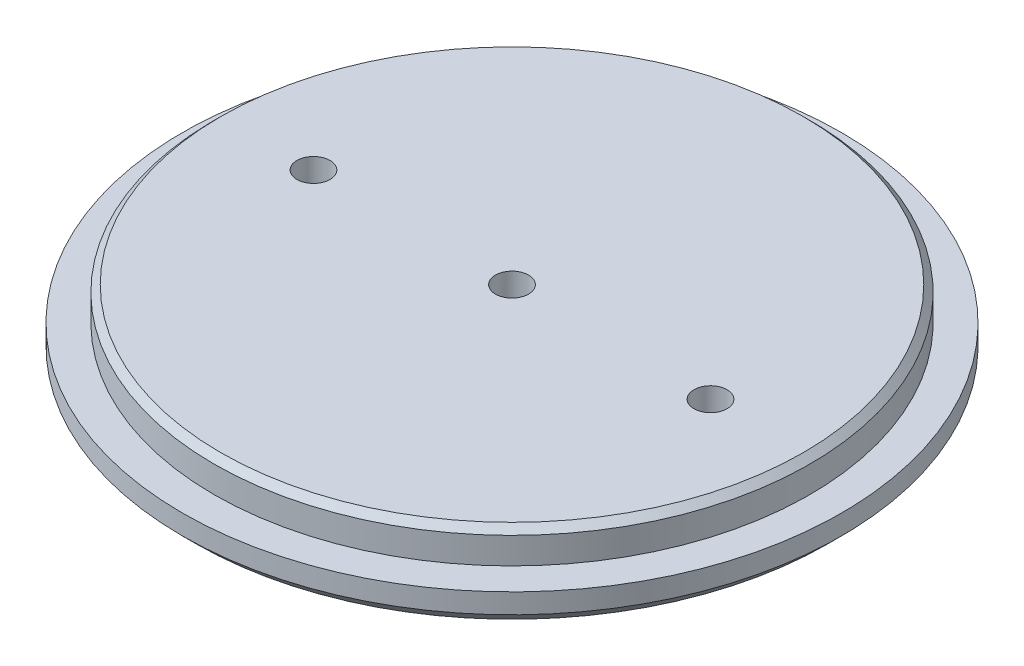
ISO-10303-21;
HEADER;
FILE_DESCRIPTION(('STEP AP214'),'2;1');
FILE_NAME('part.step','',(''),(''),'','','');
FILE_SCHEMA(('AUTOMOTIVE_DESIGN { 1 0 10303 214 1 1 1 1 }'));
ENDSEC;
DATA;
#1=APPLICATION_CONTEXT('core data for automotive mechanical design processes');
#2=APPLICATION_PROTOCOL_DEFINITION('international standard','automotive_design',2000,#1);
#3=PRODUCT_CONTEXT('',#1,'mechanical');
#4=PRODUCT('Part','Part','',(#3));
#5=PRODUCT_RELATED_PRODUCT_CATEGORY('part','',(#4));
#6=PRODUCT_DEFINITION_FORMATION('','',#4);
#7=PRODUCT_DEFINITION_CONTEXT('part definition',#1,'design');
#8=PRODUCT_DEFINITION('design','',#6,#7);
#9=PRODUCT_DEFINITION_SHAPE('','',#8);
#10=(LENGTH_UNIT() NAMED_UNIT(*) SI_UNIT(.MILLI.,.METRE.));
#11=(NAMED_UNIT(*) PLANE_ANGLE_UNIT() SI_UNIT($,.RADIAN.));
#12=(NAMED_UNIT(*) SI_UNIT($,.STERADIAN.) SOLID_ANGLE_UNIT());
#13=UNCERTAINTY_MEASURE_WITH_UNIT(LENGTH_MEASURE(1.E-05),#10,'distance_accuracy_value','');
#14=(GEOMETRIC_REPRESENTATION_CONTEXT(3) GLOBAL_UNCERTAINTY_ASSIGNED_CONTEXT((#13)) GLOBAL_UNIT_ASSIGNED_CONTEXT((#10,
#11,#12)) REPRESENTATION_CONTEXT('',''));
#15=CARTESIAN_POINT('',(0.,0.,0.));
#16=DIRECTION('',(0.,0.,1.));
#17=DIRECTION('',(1.,0.,0.));
#18=AXIS2_PLACEMENT_3D('',#15,#16,#17);
#19=CARTESIAN_POINT('',(0.,6.35,0.));
#20=DIRECTION('',(0.,-1.,0.));
#21=DIRECTION('',(0.,0.,-1.));
#22=AXIS2_PLACEMENT_3D('',#19,#20,#21);
#23=CYLINDRICAL_SURFACE('',#22,63.2460000000001);
#24=CARTESIAN_POINT('',(0.,2.54,0.));
#25=DIRECTION('',(0.,1.,0.));
#26=DIRECTION('',(0.,0.,1.));
#27=AXIS2_PLACEMENT_3D('',#24,#25,#26);
#28=CIRCLE('',#27,63.2460000000001);
#29=CARTESIAN_POINT('',(0.,2.54,63.2460000000001));
#30=VERTEX_POINT('',#29);
#31=EDGE_CURVE('E48',#30,#30,#28,.T.);
#32=ORIENTED_EDGE('',*,*,#31,.T.);
#33=EDGE_LOOP('',(#32));
#34=FACE_BOUND('',#33,.T.);
#35=CARTESIAN_POINT('',(0.,6.35,0.));
#36=DIRECTION('',(0.,1.,0.));
#37=DIRECTION('',(0.,0.,1.));
#38=AXIS2_PLACEMENT_3D('',#35,#36,#37);
#39=CIRCLE('',#38,63.2460000000001);
#40=CARTESIAN_POINT('',(0.,6.35,63.2460000000001));
#41=VERTEX_POINT('',#40);
#42=EDGE_CURVE('E62',#41,#41,#39,.T.);
#43=ORIENTED_EDGE('',*,*,#42,.F.);
#44=EDGE_LOOP('',(#43));
#45=FACE_BOUND('',#44,.T.);
#46=ADVANCED_FACE('F40',(#34,#45),#23,.T.);
#47=CARTESIAN_POINT('',(0.,6.35,0.));
#48=DIRECTION('',(0.,1.,0.));
#49=DIRECTION('',(0.,0.,1.));
#50=AXIS2_PLACEMENT_3D('',#47,#48,#49);
#51=PLANE('',#50);
#52=CARTESIAN_POINT('',(0.,6.35,0.));
#53=DIRECTION('',(0.,1.,0.));
#54=DIRECTION('',(0.,0.,1.));
#55=AXIS2_PLACEMENT_3D('',#52,#53,#54);
#56=CIRCLE('',#55,57.1500000000001);
#57=CARTESIAN_POINT('',(0.,6.35,57.1500000000001));
#58=VERTEX_POINT('',#57);
#59=EDGE_CURVE('E61',#58,#58,#56,.T.);
#60=ORIENTED_EDGE('',*,*,#59,.F.);
#61=EDGE_LOOP('',(#60));
#62=FACE_BOUND('',#61,.T.);
#63=ORIENTED_EDGE('',*,*,#42,.T.);
#64=EDGE_LOOP('',(#63));
#65=FACE_BOUND('',#64,.T.);
#66=ADVANCED_FACE('F100',(#62,#65),#51,.T.);
#67=CARTESIAN_POINT('',(0.,0.,0.));
#68=DIRECTION('',(0.,1.,0.));
#69=DIRECTION('',(0.,0.,1.));
#70=AXIS2_PLACEMENT_3D('',#67,#68,#69);
#71=PLANE('',#70);
#72=CARTESIAN_POINT('',(0.,0.,0.));
#73=DIRECTION('',(0.,1.,0.));
#74=DIRECTION('',(0.,0.,1.));
#75=AXIS2_PLACEMENT_3D('',#72,#73,#74);
#76=CIRCLE('',#75,60.7060000000001);
#77=CARTESIAN_POINT('',(0.,0.,60.7060000000001));
#78=VERTEX_POINT('',#77);
#79=EDGE_CURVE('E10',#78,#78,#76,.F.);
#80=ORIENTED_EDGE('',*,*,#79,.T.);
#81=EDGE_LOOP('',(#80));
#82=FACE_BOUND('',#81,.T.);
#83=CARTESIAN_POINT('',(-38.1,0.,0.));
#84=DIRECTION('',(0.,-1.,0.));
#85=DIRECTION('',(0.,0.,-1.));
#86=AXIS2_PLACEMENT_3D('',#83,#84,#85);
#87=CIRCLE('',#86,3.175);
#88=CARTESIAN_POINT('',(-38.1,0.,-3.175));
#89=VERTEX_POINT('',#88);
#90=EDGE_CURVE('E80',#89,#89,#87,.T.);
#91=ORIENTED_EDGE('',*,*,#90,.F.);
#92=EDGE_LOOP('',(#91));
#93=FACE_BOUND('',#92,.T.);
#94=CARTESIAN_POINT('',(0.,0.,0.));
#95=DIRECTION('',(0.,-1.,0.));
#96=DIRECTION('',(0.,0.,-1.));
#97=AXIS2_PLACEMENT_3D('',#94,#95,#96);
#98=CIRCLE('',#97,3.175);
#99=CARTESIAN_POINT('',(0.,0.,-3.175));
#100=VERTEX_POINT('',#99);
#101=EDGE_CURVE('E77',#100,#100,#98,.T.);
#102=ORIENTED_EDGE('',*,*,#101,.F.);
#103=EDGE_LOOP('',(#102));
#104=FACE_BOUND('',#103,.T.);
#105=CARTESIAN_POINT('',(38.1,0.,0.));
#106=DIRECTION('',(0.,-1.,0.));
#107=DIRECTION('',(0.,0.,-1.));
#108=AXIS2_PLACEMENT_3D('',#105,#106,#107);
#109=CIRCLE('',#108,3.175);
#110=CARTESIAN_POINT('',(38.1,0.,-3.17499999999998));
#111=VERTEX_POINT('',#110);
#112=EDGE_CURVE('E71',#111,#111,#109,.T.);
#113=ORIENTED_EDGE('',*,*,#112,.F.);
#114=EDGE_LOOP('',(#113));
#115=FACE_BOUND('',#114,.T.);
#116=ADVANCED_FACE('F96',(#82,#93,#104,#115),#71,.F.);
#117=CARTESIAN_POINT('',(0.,12.7,0.));
#118=DIRECTION('',(0.,-1.,0.));
#119=DIRECTION('',(0.,0.,-1.));
#120=AXIS2_PLACEMENT_3D('',#117,#118,#119);
#121=CYLINDRICAL_SURFACE('',#120,57.1500000000001);
#122=CARTESIAN_POINT('',(0.,11.43,0.));
#123=DIRECTION('',(0.,1.,0.));
#124=DIRECTION('',(0.,0.,1.));
#125=AXIS2_PLACEMENT_3D('',#122,#123,#124);
#126=CIRCLE('',#125,57.1500000000001);
#127=CARTESIAN_POINT('',(0.,11.43,57.1500000000001));
#128=VERTEX_POINT('',#127);
#129=EDGE_CURVE('E52',#128,#128,#126,.F.);
#130=ORIENTED_EDGE('',*,*,#129,.T.);
#131=EDGE_LOOP('',(#130));
#132=FACE_BOUND('',#131,.T.);
#133=ORIENTED_EDGE('',*,*,#59,.T.);
#134=EDGE_LOOP('',(#133));
#135=FACE_BOUND('',#134,.T.);
#136=ADVANCED_FACE('F99',(#132,#135),#121,.T.);
#137=CARTESIAN_POINT('',(0.,12.7,0.));
#138=DIRECTION('',(0.,1.,0.));
#139=DIRECTION('',(0.,0.,1.));
#140=AXIS2_PLACEMENT_3D('',#137,#138,#139);
#141=PLANE('',#140);
#142=CARTESIAN_POINT('',(-38.1,12.7,0.));
#143=DIRECTION('',(0.,-1.,0.));
#144=DIRECTION('',(0.,0.,-1.));
#145=AXIS2_PLACEMENT_3D('',#142,#143,#144);
#146=CIRCLE('',#145,3.175);
#147=CARTESIAN_POINT('',(-38.1,12.7,-3.175));
#148=VERTEX_POINT('',#147);
#149=EDGE_CURVE('E65',#148,#148,#146,.T.);
#150=ORIENTED_EDGE('',*,*,#149,.T.);
#151=EDGE_LOOP('',(#150));
#152=FACE_BOUND('',#151,.T.);
#153=CARTESIAN_POINT('',(0.,12.7,0.));
#154=DIRECTION('',(0.,-1.,0.));
#155=DIRECTION('',(0.,0.,-1.));
#156=AXIS2_PLACEMENT_3D('',#153,#154,#155);
#157=CIRCLE('',#156,3.175);
#158=CARTESIAN_POINT('',(0.,12.7,-3.175));
#159=VERTEX_POINT('',#158);
#160=EDGE_CURVE('E74',#159,#159,#157,.T.);
#161=ORIENTED_EDGE('',*,*,#160,.T.);
#162=EDGE_LOOP('',(#161));
#163=FACE_BOUND('',#162,.T.);
#164=CARTESIAN_POINT('',(38.1,12.7,0.));
#165=DIRECTION('',(0.,-1.,0.));
#166=DIRECTION('',(0.,0.,-1.));
#167=AXIS2_PLACEMENT_3D('',#164,#165,#166);
#168=CIRCLE('',#167,3.175);
#169=CARTESIAN_POINT('',(38.1,12.7,-3.17499999999998));
#170=VERTEX_POINT('',#169);
#171=EDGE_CURVE('E68',#170,#170,#168,.T.);
#172=ORIENTED_EDGE('',*,*,#171,.T.);
#173=EDGE_LOOP('',(#172));
#174=FACE_BOUND('',#173,.T.);
#175=CARTESIAN_POINT('',(0.,12.7,0.));
#176=DIRECTION('',(0.,1.,0.));
#177=DIRECTION('',(0.,0.,1.));
#178=AXIS2_PLACEMENT_3D('',#175,#176,#177);
#179=CIRCLE('',#178,55.8800000000001);
#180=CARTESIAN_POINT('',(0.,12.7,55.8800000000001));
#181=VERTEX_POINT('',#180);
#182=EDGE_CURVE('E56',#181,#181,#179,.T.);
#183=ORIENTED_EDGE('',*,*,#182,.T.);
#184=EDGE_LOOP('',(#183));
#185=FACE_BOUND('',#184,.T.);
#186=ADVANCED_FACE('F86',(#152,#163,#174,#185),#141,.T.);
#187=CARTESIAN_POINT('',(0.,12.7,0.));
#188=DIRECTION('',(0.,-1.,0.));
#189=DIRECTION('',(0.,0.,-1.));
#190=AXIS2_PLACEMENT_3D('',#187,#188,#189);
#191=CONICAL_SURFACE('',#190,55.8800000000001,0.785398163397443);
#192=ORIENTED_EDGE('',*,*,#129,.F.);
#193=EDGE_LOOP('',(#192));
#194=FACE_BOUND('',#193,.T.);
#195=ORIENTED_EDGE('',*,*,#182,.F.);
#196=EDGE_LOOP('',(#195));
#197=FACE_BOUND('',#196,.T.);
#198=ADVANCED_FACE('F108',(#194,#197),#191,.T.);
#199=CARTESIAN_POINT('',(38.1,12.7,0.));
#200=DIRECTION('',(0.,-1.,0.));
#201=DIRECTION('',(0.,0.,-1.));
#202=AXIS2_PLACEMENT_3D('',#199,#200,#201);
#203=CYLINDRICAL_SURFACE('',#202,3.175);
#204=ORIENTED_EDGE('',*,*,#171,.F.);
#205=EDGE_LOOP('',(#204));
#206=FACE_BOUND('',#205,.T.);
#207=ORIENTED_EDGE('',*,*,#112,.T.);
#208=EDGE_LOOP('',(#207));
#209=FACE_BOUND('',#208,.T.);
#210=ADVANCED_FACE('F106',(#206,#209),#203,.F.);
#211=CARTESIAN_POINT('',(0.,12.7,0.));
#212=DIRECTION('',(0.,-1.,0.));
#213=DIRECTION('',(0.,0.,-1.));
#214=AXIS2_PLACEMENT_3D('',#211,#212,#213);
#215=CYLINDRICAL_SURFACE('',#214,3.175);
#216=ORIENTED_EDGE('',*,*,#160,.F.);
#217=EDGE_LOOP('',(#216));
#218=FACE_BOUND('',#217,.T.);
#219=ORIENTED_EDGE('',*,*,#101,.T.);
#220=EDGE_LOOP('',(#219));
#221=FACE_BOUND('',#220,.T.);
#222=ADVANCED_FACE('F92',(#218,#221),#215,.F.);
#223=CARTESIAN_POINT('',(-38.1,12.7,0.));
#224=DIRECTION('',(0.,-1.,0.));
#225=DIRECTION('',(0.,0.,-1.));
#226=AXIS2_PLACEMENT_3D('',#223,#224,#225);
#227=CYLINDRICAL_SURFACE('',#226,3.175);
#228=ORIENTED_EDGE('',*,*,#149,.F.);
#229=EDGE_LOOP('',(#228));
#230=FACE_BOUND('',#229,.T.);
#231=ORIENTED_EDGE('',*,*,#90,.T.);
#232=EDGE_LOOP('',(#231));
#233=FACE_BOUND('',#232,.T.);
#234=ADVANCED_FACE('F89',(#230,#233),#227,.F.);
#235=CARTESIAN_POINT('',(0.,2.54,0.));
#236=DIRECTION('',(0.,1.,0.));
#237=DIRECTION('',(0.,0.,1.));
#238=AXIS2_PLACEMENT_3D('',#235,#236,#237);
#239=CONICAL_SURFACE('',#238,63.2460000000001,0.785398163397448);
#240=ORIENTED_EDGE('',*,*,#79,.F.);
#241=EDGE_LOOP('',(#240));
#242=FACE_BOUND('',#241,.T.);
#243=ORIENTED_EDGE('',*,*,#31,.F.);
#244=EDGE_LOOP('',(#243));
#245=FACE_BOUND('',#244,.T.);
#246=ADVANCED_FACE('F43',(#242,#245),#239,.T.);
#247=CLOSED_SHELL('',(#46,#66,#116,#136,#186,#198,#210,#222,#234,#246));
#248=MANIFOLD_SOLID_BREP('B2',#247);
#249=ADVANCED_BREP_SHAPE_REPRESENTATION('',(#18,#248),#14);
#250=SHAPE_DEFINITION_REPRESENTATION(#9,#249);
ENDSEC;
END-ISO-10303-21;
